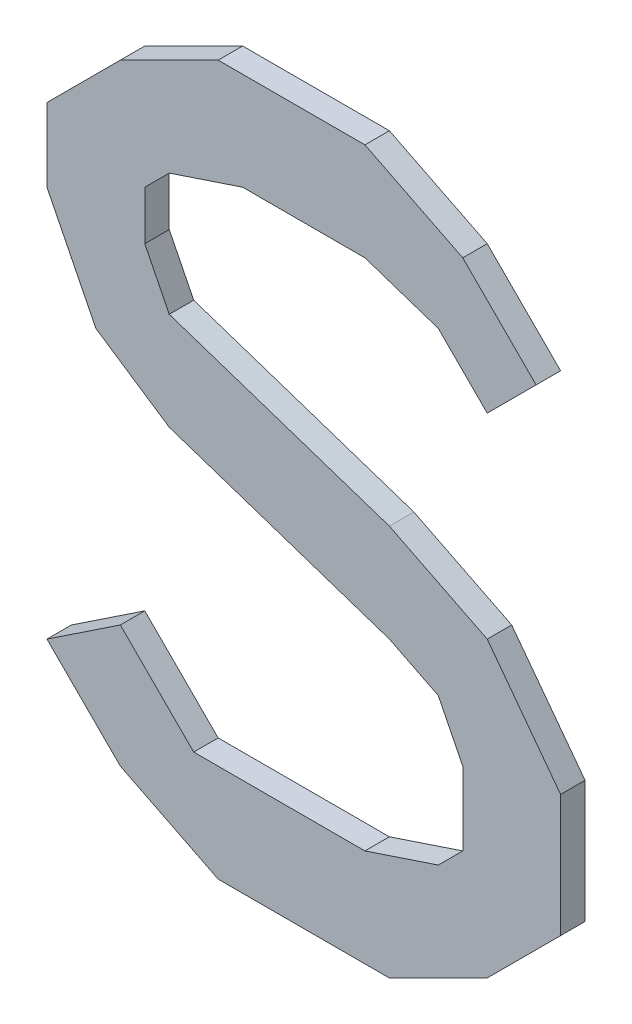
ISO-10303-21;
HEADER;
FILE_DESCRIPTION(('STEP AP214'),'2;1');
FILE_NAME('part.step','',(''),(''),'','','');
FILE_SCHEMA(('AUTOMOTIVE_DESIGN { 1 0 10303 214 1 1 1 1 }'));
ENDSEC;
DATA;
#1=APPLICATION_CONTEXT('core data for automotive mechanical design processes');
#2=APPLICATION_PROTOCOL_DEFINITION('international standard','automotive_design',2000,#1);
#3=PRODUCT_CONTEXT('',#1,'mechanical');
#4=PRODUCT('Part','Part','',(#3));
#5=PRODUCT_RELATED_PRODUCT_CATEGORY('part','',(#4));
#6=PRODUCT_DEFINITION_FORMATION('','',#4);
#7=PRODUCT_DEFINITION_CONTEXT('part definition',#1,'design');
#8=PRODUCT_DEFINITION('design','',#6,#7);
#9=PRODUCT_DEFINITION_SHAPE('','',#8);
#10=(LENGTH_UNIT() NAMED_UNIT(*) SI_UNIT(.MILLI.,.METRE.));
#11=(NAMED_UNIT(*) PLANE_ANGLE_UNIT() SI_UNIT($,.RADIAN.));
#12=(NAMED_UNIT(*) SI_UNIT($,.STERADIAN.) SOLID_ANGLE_UNIT());
#13=UNCERTAINTY_MEASURE_WITH_UNIT(LENGTH_MEASURE(1.E-05),#10,'distance_accuracy_value','');
#14=(GEOMETRIC_REPRESENTATION_CONTEXT(3) GLOBAL_UNCERTAINTY_ASSIGNED_CONTEXT((#13)) GLOBAL_UNIT_ASSIGNED_CONTEXT((#10,
#11,#12)) REPRESENTATION_CONTEXT('',''));
#15=CARTESIAN_POINT('',(0.,0.,0.));
#16=DIRECTION('',(0.,0.,1.));
#17=DIRECTION('',(1.,0.,0.));
#18=AXIS2_PLACEMENT_3D('',#15,#16,#17);
#19=CARTESIAN_POINT('',(0.07500112,0.07500112000001,0.));
#20=DIRECTION('',(0.,0.,-1.));
#21=DIRECTION('',(-1.,0.,0.));
#22=AXIS2_PLACEMENT_3D('',#19,#20,#21);
#23=PLANE('',#22);
#24=DIRECTION('',(0.707106781186548,-0.707106781186548,0.));
#25=VECTOR('',#24,1.);
#26=CARTESIAN_POINT('',(0.09500108,0.09500108,0.));
#27=LINE('',#26,#25);
#28=CARTESIAN_POINT('',(0.0650011400000088,0.125001019999999,0.));
#29=VERTEX_POINT('',#28);
#30=CARTESIAN_POINT('',(0.0950010800000023,0.0950010799999977,0.));
#31=VERTEX_POINT('',#30);
#32=EDGE_CURVE('E405',#29,#31,#27,.T.);
#33=ORIENTED_EDGE('',*,*,#32,.T.);
#34=DIRECTION('',(-0.707106781187048,-0.707106781186048,0.));
#35=VECTOR('',#34,1.);
#36=CARTESIAN_POINT('',(0.07500112,0.07500112000001,0.));
#37=LINE('',#36,#35);
#38=CARTESIAN_POINT('',(0.0750011199999975,0.0750011200000075,0.));
#39=VERTEX_POINT('',#38);
#40=EDGE_CURVE('E237',#31,#39,#37,.T.);
#41=ORIENTED_EDGE('',*,*,#40,.T.);
#42=DIRECTION('',(-0.707106781186548,0.707106781186548,0.));
#43=VECTOR('',#42,1.);
#44=CARTESIAN_POINT('',(0.05500116,0.09500108,0.));
#45=LINE('',#44,#43);
#46=CARTESIAN_POINT('',(0.0550011599999995,0.0950010799999984,0.));
#47=VERTEX_POINT('',#46);
#48=EDGE_CURVE('E19',#39,#47,#45,.T.);
#49=ORIENTED_EDGE('',*,*,#48,.T.);
#50=DIRECTION('',(-0.948683298050414,0.316227766017138,0.));
#51=VECTOR('',#50,1.);
#52=CARTESIAN_POINT('',(0.02500122000001,0.10500106,0.));
#53=LINE('',#52,#51);
#54=CARTESIAN_POINT('',(0.02500122000001,0.10500106,0.));
#55=VERTEX_POINT('',#54);
#56=EDGE_CURVE('E234',#47,#55,#53,.T.);
#57=ORIENTED_EDGE('',*,*,#56,.T.);
#58=DIRECTION('',(1.,0.,0.));
#59=VECTOR('',#58,1.);
#60=CARTESIAN_POINT('',(-0.02499868,0.10500106,0.));
#61=LINE('',#60,#59);
#62=CARTESIAN_POINT('',(-0.0249986800000005,0.105001060000002,0.));
#63=VERTEX_POINT('',#62);
#64=EDGE_CURVE('E255',#55,#63,#61,.F.);
#65=ORIENTED_EDGE('',*,*,#64,.T.);
#66=DIRECTION('',(-0.948683298050414,-0.316227766017138,0.));
#67=VECTOR('',#66,1.);
#68=CARTESIAN_POINT('',(-0.05499861999999,0.09500108,0.));
#69=LINE('',#68,#67);
#70=CARTESIAN_POINT('',(-0.0549986199999913,0.0950010800000013,0.));
#71=VERTEX_POINT('',#70);
#72=EDGE_CURVE('E260',#63,#71,#69,.T.);
#73=ORIENTED_EDGE('',*,*,#72,.T.);
#74=DIRECTION('',(-0.707106781186548,-0.707106781186548,0.));
#75=VECTOR('',#74,1.);
#76=CARTESIAN_POINT('',(-0.0649986,0.0850011,0.));
#77=LINE('',#76,#75);
#78=CARTESIAN_POINT('',(-0.0649986,0.0850011,0.));
#79=VERTEX_POINT('',#78);
#80=EDGE_CURVE('E265',#71,#79,#77,.T.);
#81=ORIENTED_EDGE('',*,*,#80,.T.);
#82=DIRECTION('',(0.,1.,0.));
#83=VECTOR('',#82,1.);
#84=CARTESIAN_POINT('',(-0.0649986,0.06500114000001,0.));
#85=LINE('',#84,#83);
#86=CARTESIAN_POINT('',(-0.064998599999999,0.0650011400000105,0.));
#87=VERTEX_POINT('',#86);
#88=EDGE_CURVE('E270',#79,#87,#85,.F.);
#89=ORIENTED_EDGE('',*,*,#88,.T.);
#90=DIRECTION('',(0.447213595499958,-0.894427190999916,0.));
#91=VECTOR('',#90,1.);
#92=CARTESIAN_POINT('',(-0.05499861999999,0.04500118,0.));
#93=LINE('',#92,#91);
#94=CARTESIAN_POINT('',(-0.0549986199999902,0.0450011799999993,0.));
#95=VERTEX_POINT('',#94);
#96=EDGE_CURVE('E275',#87,#95,#93,.T.);
#97=ORIENTED_EDGE('',*,*,#96,.T.);
#98=DIRECTION('',(0.948683298050514,-0.316227766016838,0.));
#99=VECTOR('',#98,1.);
#100=CARTESIAN_POINT('',(0.0350012,0.01500124,0.));
#101=LINE('',#100,#99);
#102=CARTESIAN_POINT('',(0.0350012000000016,0.015001240000002,0.));
#103=VERTEX_POINT('',#102);
#104=EDGE_CURVE('E280',#95,#103,#101,.T.);
#105=ORIENTED_EDGE('',*,*,#104,.T.);
#106=DIRECTION('',(0.894427190999916,-0.447213595499958,0.));
#107=VECTOR('',#106,1.);
#108=CARTESIAN_POINT('',(0.07500112,-0.004998719999989,0.));
#109=LINE('',#108,#107);
#110=CARTESIAN_POINT('',(0.0750011199999999,-0.00499871999998909,0.));
#111=VERTEX_POINT('',#110);
#112=EDGE_CURVE('E285',#103,#111,#109,.T.);
#113=ORIENTED_EDGE('',*,*,#112,.T.);
#114=DIRECTION('',(0.6,-0.8,0.));
#115=VECTOR('',#114,1.);
#116=CARTESIAN_POINT('',(0.10500106,-0.04499863999999,0.));
#117=LINE('',#116,#115);
#118=CARTESIAN_POINT('',(0.10500106,-0.04499863999999,0.));
#119=VERTEX_POINT('',#118);
#120=EDGE_CURVE('E290',#111,#119,#117,.T.);
#121=ORIENTED_EDGE('',*,*,#120,.T.);
#122=DIRECTION('',(0.,1.,0.));
#123=VECTOR('',#122,1.);
#124=CARTESIAN_POINT('',(0.10500106,-0.09499853999999,0.));
#125=LINE('',#124,#123);
#126=CARTESIAN_POINT('',(0.105001060000007,-0.0949985399999965,0.));
#127=VERTEX_POINT('',#126);
#128=EDGE_CURVE('E295',#119,#127,#125,.F.);
#129=ORIENTED_EDGE('',*,*,#128,.T.);
#130=DIRECTION('',(-0.707106781187048,-0.707106781186048,0.));
#131=VECTOR('',#130,1.);
#132=CARTESIAN_POINT('',(0.07500112,-0.12499848,0.));
#133=LINE('',#132,#131);
#134=CARTESIAN_POINT('',(0.07500112,-0.12499848,0.));
#135=VERTEX_POINT('',#134);
#136=EDGE_CURVE('E300',#127,#135,#133,.T.);
#137=ORIENTED_EDGE('',*,*,#136,.T.);
#138=DIRECTION('',(-0.894427190999916,-0.447213595499958,0.));
#139=VECTOR('',#138,1.);
#140=CARTESIAN_POINT('',(0.0350012,-0.14499844,0.));
#141=LINE('',#140,#139);
#142=CARTESIAN_POINT('',(0.0350012,-0.14499844,0.));
#143=VERTEX_POINT('',#142);
#144=EDGE_CURVE('E305',#135,#143,#141,.T.);
#145=ORIENTED_EDGE('',*,*,#144,.T.);
#146=DIRECTION('',(1.,0.,0.));
#147=VECTOR('',#146,1.);
#148=CARTESIAN_POINT('',(-0.03499866,-0.14499844,0.));
#149=LINE('',#148,#147);
#150=CARTESIAN_POINT('',(-0.03499866,-0.14499844,0.));
#151=VERTEX_POINT('',#150);
#152=EDGE_CURVE('E310',#143,#151,#149,.F.);
#153=ORIENTED_EDGE('',*,*,#152,.T.);
#154=DIRECTION('',(-0.894427190999916,0.447213595499958,0.));
#155=VECTOR('',#154,1.);
#156=CARTESIAN_POINT('',(-0.07499858,-0.12499848,0.));
#157=LINE('',#156,#155);
#158=CARTESIAN_POINT('',(-0.0749985799999988,-0.124998479999999,0.));
#159=VERTEX_POINT('',#158);
#160=EDGE_CURVE('E315',#151,#159,#157,.T.);
#161=ORIENTED_EDGE('',*,*,#160,.T.);
#162=DIRECTION('',(-0.707106781186548,0.707106781186548,0.));
#163=VECTOR('',#162,1.);
#164=CARTESIAN_POINT('',(-0.10499852,-0.09499853999999,0.));
#165=LINE('',#164,#163);
#166=CARTESIAN_POINT('',(-0.10499852,-0.0949985399999897,0.));
#167=VERTEX_POINT('',#166);
#168=EDGE_CURVE('E320',#159,#167,#165,.T.);
#169=ORIENTED_EDGE('',*,*,#168,.T.);
#170=DIRECTION('',(0.832050294337997,0.554700196224998,0.));
#171=VECTOR('',#170,1.);
#172=CARTESIAN_POINT('',(-0.07499858,-0.07499858,0.));
#173=LINE('',#172,#171);
#174=CARTESIAN_POINT('',(-0.07499858,-0.07499858,0.));
#175=VERTEX_POINT('',#174);
#176=EDGE_CURVE('E325',#167,#175,#173,.T.);
#177=ORIENTED_EDGE('',*,*,#176,.T.);
#178=DIRECTION('',(0.707106781186548,-0.707106781186548,0.));
#179=VECTOR('',#178,1.);
#180=CARTESIAN_POINT('',(-0.04499864,-0.10499852,0.));
#181=LINE('',#180,#179);
#182=CARTESIAN_POINT('',(-0.04499864,-0.10499852,0.));
#183=VERTEX_POINT('',#182);
#184=EDGE_CURVE('E330',#175,#183,#181,.T.);
#185=ORIENTED_EDGE('',*,*,#184,.T.);
#186=DIRECTION('',(1.,0.,0.));
#187=VECTOR('',#186,1.);
#188=CARTESIAN_POINT('',(0.02500122000001,-0.10499852,0.));
#189=LINE('',#188,#187);
#190=CARTESIAN_POINT('',(0.0250012200000098,-0.104998519999999,0.));
#191=VERTEX_POINT('',#190);
#192=EDGE_CURVE('E335',#183,#191,#189,.T.);
#193=ORIENTED_EDGE('',*,*,#192,.T.);
#194=DIRECTION('',(0.948683298050414,0.316227766017138,0.));
#195=VECTOR('',#194,1.);
#196=CARTESIAN_POINT('',(0.05500116,-0.09499853999999,0.));
#197=LINE('',#196,#195);
#198=CARTESIAN_POINT('',(0.0550011600000013,-0.0949985399999913,0.));
#199=VERTEX_POINT('',#198);
#200=EDGE_CURVE('E340',#191,#199,#197,.T.);
#201=ORIENTED_EDGE('',*,*,#200,.T.);
#202=DIRECTION('',(0.707106781186548,0.707106781186548,0.));
#203=VECTOR('',#202,1.);
#204=CARTESIAN_POINT('',(0.06500114000001,-0.08499855999999,0.));
#205=LINE('',#204,#203);
#206=CARTESIAN_POINT('',(0.06500114000001,-0.08499855999999,0.));
#207=VERTEX_POINT('',#206);
#208=EDGE_CURVE('E345',#199,#207,#205,.T.);
#209=ORIENTED_EDGE('',*,*,#208,.T.);
#210=DIRECTION('',(0.,1.,0.));
#211=VECTOR('',#210,1.);
#212=CARTESIAN_POINT('',(0.06500114000001,-0.05499861999999,0.));
#213=LINE('',#212,#211);
#214=CARTESIAN_POINT('',(0.065001140000007,-0.0549986199999915,0.));
#215=VERTEX_POINT('',#214);
#216=EDGE_CURVE('E350',#207,#215,#213,.T.);
#217=ORIENTED_EDGE('',*,*,#216,.T.);
#218=DIRECTION('',(-0.447213595499958,0.894427190999916,0.));
#219=VECTOR('',#218,1.);
#220=CARTESIAN_POINT('',(0.05500116,-0.03499866,0.));
#221=LINE('',#220,#219);
#222=CARTESIAN_POINT('',(0.05500116,-0.03499866,0.));
#223=VERTEX_POINT('',#222);
#224=EDGE_CURVE('E355',#215,#223,#221,.T.);
#225=ORIENTED_EDGE('',*,*,#224,.T.);
#226=DIRECTION('',(-0.894427190999916,0.447213595499958,0.));
#227=VECTOR('',#226,1.);
#228=CARTESIAN_POINT('',(0.0350012,-0.02499868,0.));
#229=LINE('',#228,#227);
#230=CARTESIAN_POINT('',(0.0350012000000003,-0.0249986799999993,0.));
#231=VERTEX_POINT('',#230);
#232=EDGE_CURVE('E360',#223,#231,#229,.T.);
#233=ORIENTED_EDGE('',*,*,#232,.T.);
#234=DIRECTION('',(-0.948683298050514,0.316227766016838,0.));
#235=VECTOR('',#234,1.);
#236=CARTESIAN_POINT('',(-0.05499861999999,0.00500126,0.));
#237=LINE('',#236,#235);
#238=CARTESIAN_POINT('',(-0.0549986199999882,0.00500126000000266,0.));
#239=VERTEX_POINT('',#238);
#240=EDGE_CURVE('E365',#231,#239,#237,.T.);
#241=ORIENTED_EDGE('',*,*,#240,.T.);
#242=DIRECTION('',(-0.832050294337997,0.554700196224998,0.));
#243=VECTOR('',#242,1.);
#244=CARTESIAN_POINT('',(-0.08499856,0.02500122000001,0.));
#245=LINE('',#244,#243);
#246=CARTESIAN_POINT('',(-0.08499856,0.02500122000001,0.));
#247=VERTEX_POINT('',#246);
#248=EDGE_CURVE('E370',#239,#247,#245,.T.);
#249=ORIENTED_EDGE('',*,*,#248,.T.);
#250=DIRECTION('',(-0.447213595499958,0.894427190999916,0.));
#251=VECTOR('',#250,1.);
#252=CARTESIAN_POINT('',(-0.10499852,0.06500114000001,0.));
#253=LINE('',#252,#251);
#254=CARTESIAN_POINT('',(-0.10499852,0.06500114000001,0.));
#255=VERTEX_POINT('',#254);
#256=EDGE_CURVE('E375',#247,#255,#253,.T.);
#257=ORIENTED_EDGE('',*,*,#256,.T.);
#258=DIRECTION('',(0.,1.,0.));
#259=VECTOR('',#258,1.);
#260=CARTESIAN_POINT('',(-0.10499852,0.09500108,0.));
#261=LINE('',#260,#259);
#262=CARTESIAN_POINT('',(-0.10499852,0.09500108,0.));
#263=VERTEX_POINT('',#262);
#264=EDGE_CURVE('E380',#255,#263,#261,.T.);
#265=ORIENTED_EDGE('',*,*,#264,.T.);
#266=DIRECTION('',(0.707106781186548,0.707106781186548,0.));
#267=VECTOR('',#266,1.);
#268=CARTESIAN_POINT('',(-0.07499858,0.12500102,0.));
#269=LINE('',#268,#267);
#270=CARTESIAN_POINT('',(-0.07499858,0.12500102,0.));
#271=VERTEX_POINT('',#270);
#272=EDGE_CURVE('E385',#263,#271,#269,.T.);
#273=ORIENTED_EDGE('',*,*,#272,.T.);
#274=DIRECTION('',(0.894427190999916,0.447213595499958,0.));
#275=VECTOR('',#274,1.);
#276=CARTESIAN_POINT('',(-0.03499866,0.14500098,0.));
#277=LINE('',#276,#275);
#278=CARTESIAN_POINT('',(-0.03499866,0.14500098,0.));
#279=VERTEX_POINT('',#278);
#280=EDGE_CURVE('E390',#271,#279,#277,.T.);
#281=ORIENTED_EDGE('',*,*,#280,.T.);
#282=DIRECTION('',(1.,0.,0.));
#283=VECTOR('',#282,1.);
#284=CARTESIAN_POINT('',(0.02500122000001,0.14500098,0.));
#285=LINE('',#284,#283);
#286=CARTESIAN_POINT('',(0.02500122000001,0.14500098,0.));
#287=VERTEX_POINT('',#286);
#288=EDGE_CURVE('E395',#279,#287,#285,.T.);
#289=ORIENTED_EDGE('',*,*,#288,.T.);
#290=DIRECTION('',(0.894427190999916,-0.447213595499958,0.));
#291=VECTOR('',#290,1.);
#292=CARTESIAN_POINT('',(0.06500114000001,0.12500102,0.));
#293=LINE('',#292,#291);
#294=EDGE_CURVE('E400',#287,#29,#293,.T.);
#295=ORIENTED_EDGE('',*,*,#294,.T.);
#296=EDGE_LOOP('',(#33,#41,#49,#57,#65,#73,#81,#89,#97,#105,#113,#121,#129,#137,#145,#153,#161,
#169,#177,#185,#193,#201,#209,#217,#225,#233,#241,#249,#257,#265,#273,#281,#289,#295));
#297=FACE_BOUND('',#296,.T.);
#298=ADVANCED_FACE('F16',(#297),#23,.T.);
#299=CARTESIAN_POINT('',(0.05500116,0.09500108,0.));
#300=DIRECTION('',(0.707106781186548,0.707106781186548,0.));
#301=DIRECTION('',(-0.707106781186548,0.707106781186548,0.));
#302=AXIS2_PLACEMENT_3D('',#299,#300,#301);
#303=PLANE('',#302);
#304=DIRECTION('',(0.,0.,1.));
#305=VECTOR('',#304,1.);
#306=CARTESIAN_POINT('',(0.07500112,0.07500112000001,0.));
#307=LINE('',#306,#305);
#308=CARTESIAN_POINT('',(0.0750011199999975,0.0750011200000075,0.01));
#309=VERTEX_POINT('',#308);
#310=EDGE_CURVE('E407',#39,#309,#307,.T.);
#311=ORIENTED_EDGE('',*,*,#310,.T.);
#312=DIRECTION('',(-0.707106781186724,0.707106781186371,0.));
#313=VECTOR('',#312,1.);
#314=CARTESIAN_POINT('',(0.07500112,0.07500112000001,0.01));
#315=LINE('',#314,#313);
#316=CARTESIAN_POINT('',(0.0550011599999995,0.0950010799999984,0.01));
#317=VERTEX_POINT('',#316);
#318=EDGE_CURVE('E252',#309,#317,#315,.T.);
#319=ORIENTED_EDGE('',*,*,#318,.T.);
#320=DIRECTION('',(0.,0.,1.));
#321=VECTOR('',#320,1.);
#322=CARTESIAN_POINT('',(0.0550011599999978,0.0950010799999935,0.));
#323=LINE('',#322,#321);
#324=EDGE_CURVE('E242',#317,#47,#323,.F.);
#325=ORIENTED_EDGE('',*,*,#324,.T.);
#326=ORIENTED_EDGE('',*,*,#48,.F.);
#327=EDGE_LOOP('',(#311,#319,#325,#326));
#328=FACE_BOUND('',#327,.T.);
#329=ADVANCED_FACE('F251',(#328),#303,.F.);
#330=CARTESIAN_POINT('',(0.02500122000001,0.10500106,0.));
#331=DIRECTION('',(0.316227766017138,0.948683298050414,0.));
#332=DIRECTION('',(-0.948683298050414,0.316227766017138,0.));
#333=AXIS2_PLACEMENT_3D('',#330,#331,#332);
#334=PLANE('',#333);
#335=ORIENTED_EDGE('',*,*,#324,.F.);
#336=DIRECTION('',(-0.948683298050482,0.316227766016933,0.));
#337=VECTOR('',#336,1.);
#338=CARTESIAN_POINT('',(0.05500116,0.09500108,0.01));
#339=LINE('',#338,#337);
#340=CARTESIAN_POINT('',(0.02500122000001,0.10500106,0.01));
#341=VERTEX_POINT('',#340);
#342=EDGE_CURVE('E412',#317,#341,#339,.T.);
#343=ORIENTED_EDGE('',*,*,#342,.T.);
#344=DIRECTION('',(0.,0.,1.));
#345=VECTOR('',#344,1.);
#346=CARTESIAN_POINT('',(0.02500122000001,0.10500106,0.));
#347=LINE('',#346,#345);
#348=EDGE_CURVE('E248',#341,#55,#347,.F.);
#349=ORIENTED_EDGE('',*,*,#348,.T.);
#350=ORIENTED_EDGE('',*,*,#56,.F.);
#351=EDGE_LOOP('',(#335,#343,#349,#350));
#352=FACE_BOUND('',#351,.T.);
#353=ADVANCED_FACE('F245',(#352),#334,.F.);
#354=CARTESIAN_POINT('',(-0.02499868,0.10500106,0.));
#355=DIRECTION('',(0.,1.,0.));
#356=DIRECTION('',(0.,0.,1.));
#357=AXIS2_PLACEMENT_3D('',#354,#355,#356);
#358=PLANE('',#357);
#359=ORIENTED_EDGE('',*,*,#348,.F.);
#360=DIRECTION('',(-1.,0.,0.));
#361=VECTOR('',#360,1.);
#362=CARTESIAN_POINT('',(0.07500112,0.10500106,0.01));
#363=LINE('',#362,#361);
#364=CARTESIAN_POINT('',(-0.0249986800000005,0.105001060000002,0.01));
#365=VERTEX_POINT('',#364);
#366=EDGE_CURVE('E414',#341,#365,#363,.T.);
#367=ORIENTED_EDGE('',*,*,#366,.T.);
#368=DIRECTION('',(0.,0.,1.));
#369=VECTOR('',#368,1.);
#370=CARTESIAN_POINT('',(-0.0249986800000022,0.105001060000006,0.));
#371=LINE('',#370,#369);
#372=EDGE_CURVE('E257',#365,#63,#371,.F.);
#373=ORIENTED_EDGE('',*,*,#372,.T.);
#374=ORIENTED_EDGE('',*,*,#64,.F.);
#375=EDGE_LOOP('',(#359,#367,#373,#374));
#376=FACE_BOUND('',#375,.T.);
#377=ADVANCED_FACE('F629',(#376),#358,.F.);
#378=CARTESIAN_POINT('',(-0.05499861999999,0.09500108,0.));
#379=DIRECTION('',(-0.316227766017138,0.948683298050414,0.));
#380=DIRECTION('',(-0.948683298050414,-0.316227766017138,0.));
#381=AXIS2_PLACEMENT_3D('',#378,#379,#380);
#382=PLANE('',#381);
#383=ORIENTED_EDGE('',*,*,#372,.F.);
#384=DIRECTION('',(-0.948683298050482,-0.316227766016933,0.));
#385=VECTOR('',#384,1.);
#386=CARTESIAN_POINT('',(-0.02499868,0.10500106,0.01));
#387=LINE('',#386,#385);
#388=CARTESIAN_POINT('',(-0.0549986199999913,0.0950010800000013,0.01));
#389=VERTEX_POINT('',#388);
#390=EDGE_CURVE('E417',#365,#389,#387,.T.);
#391=ORIENTED_EDGE('',*,*,#390,.T.);
#392=DIRECTION('',(0.,0.,1.));
#393=VECTOR('',#392,1.);
#394=CARTESIAN_POINT('',(-0.054998619999995,0.095001080000005,0.));
#395=LINE('',#394,#393);
#396=EDGE_CURVE('E262',#389,#71,#395,.F.);
#397=ORIENTED_EDGE('',*,*,#396,.T.);
#398=ORIENTED_EDGE('',*,*,#72,.F.);
#399=EDGE_LOOP('',(#383,#391,#397,#398));
#400=FACE_BOUND('',#399,.T.);
#401=ADVANCED_FACE('F626',(#400),#382,.F.);
#402=CARTESIAN_POINT('',(-0.0649986,0.0850011,0.));
#403=DIRECTION('',(-0.707106781186548,0.707106781186548,0.));
#404=DIRECTION('',(-0.707106781186548,-0.707106781186548,0.));
#405=AXIS2_PLACEMENT_3D('',#402,#403,#404);
#406=PLANE('',#405);
#407=ORIENTED_EDGE('',*,*,#396,.F.);
#408=DIRECTION('',(-0.707106781186902,-0.707106781186193,0.));
#409=VECTOR('',#408,1.);
#410=CARTESIAN_POINT('',(-0.05499861999999,0.09500108,0.01));
#411=LINE('',#410,#409);
#412=CARTESIAN_POINT('',(-0.0649986,0.0850011,0.01));
#413=VERTEX_POINT('',#412);
#414=EDGE_CURVE('E420',#389,#413,#411,.T.);
#415=ORIENTED_EDGE('',*,*,#414,.T.);
#416=DIRECTION('',(0.,0.,1.));
#417=VECTOR('',#416,1.);
#418=CARTESIAN_POINT('',(-0.0649986,0.0850011,0.));
#419=LINE('',#418,#417);
#420=EDGE_CURVE('E267',#413,#79,#419,.F.);
#421=ORIENTED_EDGE('',*,*,#420,.T.);
#422=ORIENTED_EDGE('',*,*,#80,.F.);
#423=EDGE_LOOP('',(#407,#415,#421,#422));
#424=FACE_BOUND('',#423,.T.);
#425=ADVANCED_FACE('F622',(#424),#406,.F.);
#426=CARTESIAN_POINT('',(-0.0649986,0.06500114000001,0.));
#427=DIRECTION('',(-1.,0.,0.));
#428=DIRECTION('',(0.,0.,1.));
#429=AXIS2_PLACEMENT_3D('',#426,#427,#428);
#430=PLANE('',#429);
#431=ORIENTED_EDGE('',*,*,#420,.F.);
#432=DIRECTION('',(0.,1.,0.));
#433=VECTOR('',#432,1.);
#434=CARTESIAN_POINT('',(-0.0649986,0.07500112000001,0.01));
#435=LINE('',#434,#433);
#436=CARTESIAN_POINT('',(-0.064998599999999,0.0650011400000105,0.01));
#437=VERTEX_POINT('',#436);
#438=EDGE_CURVE('E423',#413,#437,#435,.F.);
#439=ORIENTED_EDGE('',*,*,#438,.T.);
#440=DIRECTION('',(0.,0.,1.));
#441=VECTOR('',#440,1.);
#442=CARTESIAN_POINT('',(-0.064998599999996,0.065001140000012,0.));
#443=LINE('',#442,#441);
#444=EDGE_CURVE('E272',#437,#87,#443,.F.);
#445=ORIENTED_EDGE('',*,*,#444,.T.);
#446=ORIENTED_EDGE('',*,*,#88,.F.);
#447=EDGE_LOOP('',(#431,#439,#445,#446));
#448=FACE_BOUND('',#447,.T.);
#449=ADVANCED_FACE('F618',(#448),#430,.F.);
#450=CARTESIAN_POINT('',(-0.05499861999999,0.04500118,0.));
#451=DIRECTION('',(-0.894427190999916,-0.447213595499958,0.));
#452=DIRECTION('',(0.447213595499958,-0.894427190999916,0.));
#453=AXIS2_PLACEMENT_3D('',#450,#451,#452);
#454=PLANE('',#453);
#455=ORIENTED_EDGE('',*,*,#444,.F.);
#456=DIRECTION('',(0.447213595500138,-0.894427190999826,0.));
#457=VECTOR('',#456,1.);
#458=CARTESIAN_POINT('',(-0.0649986,0.06500114000001,0.01));
#459=LINE('',#458,#457);
#460=CARTESIAN_POINT('',(-0.0549986199999902,0.0450011799999993,0.01));
#461=VERTEX_POINT('',#460);
#462=EDGE_CURVE('E426',#437,#461,#459,.T.);
#463=ORIENTED_EDGE('',*,*,#462,.T.);
#464=DIRECTION('',(0.,0.,1.));
#465=VECTOR('',#464,1.);
#466=CARTESIAN_POINT('',(-0.054998619999991,0.045001179999997,0.));
#467=LINE('',#466,#465);
#468=EDGE_CURVE('E277',#461,#95,#467,.F.);
#469=ORIENTED_EDGE('',*,*,#468,.T.);
#470=ORIENTED_EDGE('',*,*,#96,.F.);
#471=EDGE_LOOP('',(#455,#463,#469,#470));
#472=FACE_BOUND('',#471,.T.);
#473=ADVANCED_FACE('F614',(#472),#454,.F.);
#474=CARTESIAN_POINT('',(0.0350012,0.01500124,0.));
#475=DIRECTION('',(-0.316227766016838,-0.948683298050514,0.));
#476=DIRECTION('',(0.948683298050514,-0.316227766016838,0.));
#477=AXIS2_PLACEMENT_3D('',#474,#475,#476);
#478=PLANE('',#477);
#479=ORIENTED_EDGE('',*,*,#468,.F.);
#480=DIRECTION('',(0.948683298050503,-0.31622776601687,0.));
#481=VECTOR('',#480,1.);
#482=CARTESIAN_POINT('',(-0.05499861999999,0.04500118,0.01));
#483=LINE('',#482,#481);
#484=CARTESIAN_POINT('',(0.0350012000000016,0.015001240000002,0.01));
#485=VERTEX_POINT('',#484);
#486=EDGE_CURVE('E429',#461,#485,#483,.T.);
#487=ORIENTED_EDGE('',*,*,#486,.T.);
#488=DIRECTION('',(0.,0.,1.));
#489=VECTOR('',#488,1.);
#490=CARTESIAN_POINT('',(0.0350012000000044,0.0150012400000088,0.));
#491=LINE('',#490,#489);
#492=EDGE_CURVE('E282',#485,#103,#491,.F.);
#493=ORIENTED_EDGE('',*,*,#492,.T.);
#494=ORIENTED_EDGE('',*,*,#104,.F.);
#495=EDGE_LOOP('',(#479,#487,#493,#494));
#496=FACE_BOUND('',#495,.T.);
#497=ADVANCED_FACE('F610',(#496),#478,.F.);
#498=CARTESIAN_POINT('',(0.07500112,-0.004998719999989,0.));
#499=DIRECTION('',(-0.447213595499958,-0.894427190999916,0.));
#500=DIRECTION('',(0.894427190999916,-0.447213595499958,0.));
#501=AXIS2_PLACEMENT_3D('',#498,#499,#500);
#502=PLANE('',#501);
#503=ORIENTED_EDGE('',*,*,#492,.F.);
#504=DIRECTION('',(0.894427191000014,-0.447213595499761,0.));
#505=VECTOR('',#504,1.);
#506=CARTESIAN_POINT('',(0.0350012,0.01500124,0.01));
#507=LINE('',#506,#505);
#508=CARTESIAN_POINT('',(0.0750011199999999,-0.00499871999998909,0.01));
#509=VERTEX_POINT('',#508);
#510=EDGE_CURVE('E432',#485,#509,#507,.T.);
#511=ORIENTED_EDGE('',*,*,#510,.T.);
#512=DIRECTION('',(0.,0.,1.));
#513=VECTOR('',#512,1.);
#514=CARTESIAN_POINT('',(0.0750011199999995,-0.00499871999998936,0.));
#515=LINE('',#514,#513);
#516=EDGE_CURVE('E287',#509,#111,#515,.F.);
#517=ORIENTED_EDGE('',*,*,#516,.T.);
#518=ORIENTED_EDGE('',*,*,#112,.F.);
#519=EDGE_LOOP('',(#503,#511,#517,#518));
#520=FACE_BOUND('',#519,.T.);
#521=ADVANCED_FACE('F606',(#520),#502,.F.);
#522=CARTESIAN_POINT('',(0.10500106,-0.04499863999999,0.));
#523=DIRECTION('',(-0.8,-0.6,0.));
#524=DIRECTION('',(0.6,-0.8,0.));
#525=AXIS2_PLACEMENT_3D('',#522,#523,#524);
#526=PLANE('',#525);
#527=ORIENTED_EDGE('',*,*,#516,.F.);
#528=DIRECTION('',(0.59999999999999,-0.800000000000007,0.));
#529=VECTOR('',#528,1.);
#530=CARTESIAN_POINT('',(0.07500112,-0.004998719999989,0.01));
#531=LINE('',#530,#529);
#532=CARTESIAN_POINT('',(0.10500106,-0.04499863999999,0.01));
#533=VERTEX_POINT('',#532);
#534=EDGE_CURVE('E435',#509,#533,#531,.T.);
#535=ORIENTED_EDGE('',*,*,#534,.T.);
#536=DIRECTION('',(0.,0.,1.));
#537=VECTOR('',#536,1.);
#538=CARTESIAN_POINT('',(0.10500106,-0.04499863999999,0.));
#539=LINE('',#538,#537);
#540=EDGE_CURVE('E292',#533,#119,#539,.F.);
#541=ORIENTED_EDGE('',*,*,#540,.T.);
#542=ORIENTED_EDGE('',*,*,#120,.F.);
#543=EDGE_LOOP('',(#527,#535,#541,#542));
#544=FACE_BOUND('',#543,.T.);
#545=ADVANCED_FACE('F602',(#544),#526,.F.);
#546=CARTESIAN_POINT('',(0.10500106,-0.09499853999999,0.));
#547=DIRECTION('',(-1.,0.,0.));
#548=DIRECTION('',(0.,0.,1.));
#549=AXIS2_PLACEMENT_3D('',#546,#547,#548);
#550=PLANE('',#549);
#551=ORIENTED_EDGE('',*,*,#540,.F.);
#552=DIRECTION('',(0.,1.,0.));
#553=VECTOR('',#552,1.);
#554=CARTESIAN_POINT('',(0.10500106,0.07500112000001,0.01));
#555=LINE('',#554,#553);
#556=CARTESIAN_POINT('',(0.105001060000007,-0.0949985399999965,0.01));
#557=VERTEX_POINT('',#556);
#558=EDGE_CURVE('E438',#533,#557,#555,.F.);
#559=ORIENTED_EDGE('',*,*,#558,.T.);
#560=DIRECTION('',(0.,0.,1.));
#561=VECTOR('',#560,1.);
#562=CARTESIAN_POINT('',(0.105001060000026,-0.0949985400000162,0.));
#563=LINE('',#562,#561);
#564=EDGE_CURVE('E297',#557,#127,#563,.F.);
#565=ORIENTED_EDGE('',*,*,#564,.T.);
#566=ORIENTED_EDGE('',*,*,#128,.F.);
#567=EDGE_LOOP('',(#551,#559,#565,#566));
#568=FACE_BOUND('',#567,.T.);
#569=ADVANCED_FACE('F598',(#568),#550,.F.);
#570=CARTESIAN_POINT('',(0.07500112,-0.12499848,0.));
#571=DIRECTION('',(-0.707106781186048,0.707106781187048,0.));
#572=DIRECTION('',(-0.707106781187048,-0.707106781186048,0.));
#573=AXIS2_PLACEMENT_3D('',#570,#571,#572);
#574=PLANE('',#573);
#575=ORIENTED_EDGE('',*,*,#564,.F.);
#576=DIRECTION('',(-0.70710678118643,-0.707106781186666,0.));
#577=VECTOR('',#576,1.);
#578=CARTESIAN_POINT('',(0.10500106,-0.09499853999999,0.01));
#579=LINE('',#578,#577);
#580=CARTESIAN_POINT('',(0.07500112,-0.12499848,0.01));
#581=VERTEX_POINT('',#580);
#582=EDGE_CURVE('E441',#557,#581,#579,.T.);
#583=ORIENTED_EDGE('',*,*,#582,.T.);
#584=DIRECTION('',(0.,0.,1.));
#585=VECTOR('',#584,1.);
#586=CARTESIAN_POINT('',(0.07500112,-0.12499848,0.));
#587=LINE('',#586,#585);
#588=EDGE_CURVE('E302',#581,#135,#587,.F.);
#589=ORIENTED_EDGE('',*,*,#588,.T.);
#590=ORIENTED_EDGE('',*,*,#136,.F.);
#591=EDGE_LOOP('',(#575,#583,#589,#590));
#592=FACE_BOUND('',#591,.T.);
#593=ADVANCED_FACE('F594',(#592),#574,.F.);
#594=CARTESIAN_POINT('',(0.0350012,-0.14499844,0.));
#595=DIRECTION('',(-0.447213595499958,0.894427190999916,0.));
#596=DIRECTION('',(-0.894427190999916,-0.447213595499958,0.));
#597=AXIS2_PLACEMENT_3D('',#594,#595,#596);
#598=PLANE('',#597);
#599=ORIENTED_EDGE('',*,*,#588,.F.);
#600=DIRECTION('',(-0.894427190999916,-0.447213595499958,0.));
#601=VECTOR('',#600,1.);
#602=CARTESIAN_POINT('',(0.07500112,-0.12499848,0.01));
#603=LINE('',#602,#601);
#604=CARTESIAN_POINT('',(0.0350012,-0.14499844,0.01));
#605=VERTEX_POINT('',#604);
#606=EDGE_CURVE('E444',#581,#605,#603,.T.);
#607=ORIENTED_EDGE('',*,*,#606,.T.);
#608=DIRECTION('',(0.,0.,1.));
#609=VECTOR('',#608,1.);
#610=CARTESIAN_POINT('',(0.0350012,-0.14499844,0.));
#611=LINE('',#610,#609);
#612=EDGE_CURVE('E307',#605,#143,#611,.F.);
#613=ORIENTED_EDGE('',*,*,#612,.T.);
#614=ORIENTED_EDGE('',*,*,#144,.F.);
#615=EDGE_LOOP('',(#599,#607,#613,#614));
#616=FACE_BOUND('',#615,.T.);
#617=ADVANCED_FACE('F590',(#616),#598,.F.);
#618=CARTESIAN_POINT('',(-0.03499866,-0.14499844,0.));
#619=DIRECTION('',(0.,1.,0.));
#620=DIRECTION('',(0.,0.,1.));
#621=AXIS2_PLACEMENT_3D('',#618,#619,#620);
#622=PLANE('',#621);
#623=ORIENTED_EDGE('',*,*,#612,.F.);
#624=DIRECTION('',(-1.,0.,0.));
#625=VECTOR('',#624,1.);
#626=CARTESIAN_POINT('',(0.07500112,-0.14499844,0.01));
#627=LINE('',#626,#625);
#628=CARTESIAN_POINT('',(-0.03499866,-0.14499844,0.01));
#629=VERTEX_POINT('',#628);
#630=EDGE_CURVE('E447',#605,#629,#627,.T.);
#631=ORIENTED_EDGE('',*,*,#630,.T.);
#632=DIRECTION('',(0.,0.,1.));
#633=VECTOR('',#632,1.);
#634=CARTESIAN_POINT('',(-0.03499866,-0.14499844,0.));
#635=LINE('',#634,#633);
#636=EDGE_CURVE('E312',#629,#151,#635,.F.);
#637=ORIENTED_EDGE('',*,*,#636,.T.);
#638=ORIENTED_EDGE('',*,*,#152,.F.);
#639=EDGE_LOOP('',(#623,#631,#637,#638));
#640=FACE_BOUND('',#639,.T.);
#641=ADVANCED_FACE('F586',(#640),#622,.F.);
#642=CARTESIAN_POINT('',(-0.07499858,-0.12499848,0.));
#643=DIRECTION('',(0.447213595499958,0.894427190999916,0.));
#644=DIRECTION('',(-0.894427190999916,0.447213595499958,0.));
#645=AXIS2_PLACEMENT_3D('',#642,#643,#644);
#646=PLANE('',#645);
#647=ORIENTED_EDGE('',*,*,#636,.F.);
#648=DIRECTION('',(-0.894427190999916,0.447213595499958,0.));
#649=VECTOR('',#648,1.);
#650=CARTESIAN_POINT('',(-0.03499866,-0.14499844,0.01));
#651=LINE('',#650,#649);
#652=CARTESIAN_POINT('',(-0.0749985799999988,-0.124998479999999,0.01));
#653=VERTEX_POINT('',#652);
#654=EDGE_CURVE('E450',#629,#653,#651,.T.);
#655=ORIENTED_EDGE('',*,*,#654,.T.);
#656=DIRECTION('',(0.,0.,1.));
#657=VECTOR('',#656,1.);
#658=CARTESIAN_POINT('',(-0.074998579999995,-0.124998479999995,0.));
#659=LINE('',#658,#657);
#660=EDGE_CURVE('E317',#653,#159,#659,.F.);
#661=ORIENTED_EDGE('',*,*,#660,.T.);
#662=ORIENTED_EDGE('',*,*,#160,.F.);
#663=EDGE_LOOP('',(#647,#655,#661,#662));
#664=FACE_BOUND('',#663,.T.);
#665=ADVANCED_FACE('F582',(#664),#646,.F.);
#666=CARTESIAN_POINT('',(-0.10499852,-0.09499853999999,0.));
#667=DIRECTION('',(0.707106781186548,0.707106781186548,0.));
#668=DIRECTION('',(-0.707106781186548,0.707106781186548,0.));
#669=AXIS2_PLACEMENT_3D('',#666,#667,#668);
#670=PLANE('',#669);
#671=ORIENTED_EDGE('',*,*,#660,.F.);
#672=DIRECTION('',(-0.70710678118643,0.707106781186666,0.));
#673=VECTOR('',#672,1.);
#674=CARTESIAN_POINT('',(-0.07499858,-0.12499848,0.01));
#675=LINE('',#674,#673);
#676=CARTESIAN_POINT('',(-0.10499852,-0.0949985399999897,0.01));
#677=VERTEX_POINT('',#676);
#678=EDGE_CURVE('E453',#653,#677,#675,.T.);
#679=ORIENTED_EDGE('',*,*,#678,.T.);
#680=DIRECTION('',(0.,0.,1.));
#681=VECTOR('',#680,1.);
#682=CARTESIAN_POINT('',(-0.104998520000001,-0.0949985399999886,0.));
#683=LINE('',#682,#681);
#684=EDGE_CURVE('E322',#677,#167,#683,.F.);
#685=ORIENTED_EDGE('',*,*,#684,.T.);
#686=ORIENTED_EDGE('',*,*,#168,.F.);
#687=EDGE_LOOP('',(#671,#679,#685,#686));
#688=FACE_BOUND('',#687,.T.);
#689=ADVANCED_FACE('F578',(#688),#670,.F.);
#690=CARTESIAN_POINT('',(-0.07499858,-0.07499858,0.));
#691=DIRECTION('',(0.554700196224998,-0.832050294337997,0.));
#692=DIRECTION('',(0.832050294337997,0.554700196224998,0.));
#693=AXIS2_PLACEMENT_3D('',#690,#691,#692);
#694=PLANE('',#693);
#695=ORIENTED_EDGE('',*,*,#684,.F.);
#696=DIRECTION('',(0.832050294337972,0.554700196225037,0.));
#697=VECTOR('',#696,1.);
#698=CARTESIAN_POINT('',(-0.10499852,-0.09499853999999,0.01));
#699=LINE('',#698,#697);
#700=CARTESIAN_POINT('',(-0.07499858,-0.07499858,0.01));
#701=VERTEX_POINT('',#700);
#702=EDGE_CURVE('E456',#677,#701,#699,.T.);
#703=ORIENTED_EDGE('',*,*,#702,.T.);
#704=DIRECTION('',(0.,0.,1.));
#705=VECTOR('',#704,1.);
#706=CARTESIAN_POINT('',(-0.07499858,-0.07499858,0.));
#707=LINE('',#706,#705);
#708=EDGE_CURVE('E327',#701,#175,#707,.F.);
#709=ORIENTED_EDGE('',*,*,#708,.T.);
#710=ORIENTED_EDGE('',*,*,#176,.F.);
#711=EDGE_LOOP('',(#695,#703,#709,#710));
#712=FACE_BOUND('',#711,.T.);
#713=ADVANCED_FACE('F574',(#712),#694,.F.);
#714=CARTESIAN_POINT('',(-0.04499864,-0.10499852,0.));
#715=DIRECTION('',(-0.707106781186548,-0.707106781186548,0.));
#716=DIRECTION('',(0.707106781186548,-0.707106781186548,0.));
#717=AXIS2_PLACEMENT_3D('',#714,#715,#716);
#718=PLANE('',#717);
#719=ORIENTED_EDGE('',*,*,#708,.F.);
#720=DIRECTION('',(0.707106781186548,-0.707106781186547,0.));
#721=VECTOR('',#720,1.);
#722=CARTESIAN_POINT('',(-0.07499858,-0.07499858,0.01));
#723=LINE('',#722,#721);
#724=CARTESIAN_POINT('',(-0.04499864,-0.10499852,0.01));
#725=VERTEX_POINT('',#724);
#726=EDGE_CURVE('E459',#701,#725,#723,.T.);
#727=ORIENTED_EDGE('',*,*,#726,.T.);
#728=DIRECTION('',(0.,0.,-1.));
#729=VECTOR('',#728,1.);
#730=CARTESIAN_POINT('',(-0.04499864,-0.10499852,0.));
#731=LINE('',#730,#729);
#732=EDGE_CURVE('E332',#725,#183,#731,.T.);
#733=ORIENTED_EDGE('',*,*,#732,.T.);
#734=ORIENTED_EDGE('',*,*,#184,.F.);
#735=EDGE_LOOP('',(#719,#727,#733,#734));
#736=FACE_BOUND('',#735,.T.);
#737=ADVANCED_FACE('F570',(#736),#718,.F.);
#738=CARTESIAN_POINT('',(0.02500122000001,-0.10499852,0.));
#739=DIRECTION('',(0.,-1.,0.));
#740=DIRECTION('',(0.,0.,-1.));
#741=AXIS2_PLACEMENT_3D('',#738,#739,#740);
#742=PLANE('',#741);
#743=ORIENTED_EDGE('',*,*,#732,.F.);
#744=DIRECTION('',(-1.,0.,0.));
#745=VECTOR('',#744,1.);
#746=CARTESIAN_POINT('',(0.07500112,-0.10499852,0.01));
#747=LINE('',#746,#745);
#748=CARTESIAN_POINT('',(0.0250012200000098,-0.104998519999999,0.01));
#749=VERTEX_POINT('',#748);
#750=EDGE_CURVE('E462',#725,#749,#747,.F.);
#751=ORIENTED_EDGE('',*,*,#750,.T.);
#752=DIRECTION('',(0.,0.,1.));
#753=VECTOR('',#752,1.);
#754=CARTESIAN_POINT('',(0.0250012200000092,-0.104998519999997,0.));
#755=LINE('',#754,#753);
#756=EDGE_CURVE('E337',#749,#191,#755,.F.);
#757=ORIENTED_EDGE('',*,*,#756,.T.);
#758=ORIENTED_EDGE('',*,*,#192,.F.);
#759=EDGE_LOOP('',(#743,#751,#757,#758));
#760=FACE_BOUND('',#759,.T.);
#761=ADVANCED_FACE('F566',(#760),#742,.F.);
#762=CARTESIAN_POINT('',(0.05500116,-0.09499853999999,0.));
#763=DIRECTION('',(0.316227766017138,-0.948683298050414,0.));
#764=DIRECTION('',(0.948683298050414,0.316227766017138,0.));
#765=AXIS2_PLACEMENT_3D('',#762,#763,#764);
#766=PLANE('',#765);
#767=ORIENTED_EDGE('',*,*,#756,.F.);
#768=DIRECTION('',(0.948683298050387,0.316227766017217,0.));
#769=VECTOR('',#768,1.);
#770=CARTESIAN_POINT('',(0.02500122000001,-0.10499852,0.01));
#771=LINE('',#770,#769);
#772=CARTESIAN_POINT('',(0.0550011600000013,-0.0949985399999913,0.01));
#773=VERTEX_POINT('',#772);
#774=EDGE_CURVE('E465',#749,#773,#771,.T.);
#775=ORIENTED_EDGE('',*,*,#774,.T.);
#776=DIRECTION('',(0.,0.,1.));
#777=VECTOR('',#776,1.);
#778=CARTESIAN_POINT('',(0.055001160000005,-0.094998539999995,0.));
#779=LINE('',#778,#777);
#780=EDGE_CURVE('E342',#773,#199,#779,.F.);
#781=ORIENTED_EDGE('',*,*,#780,.T.);
#782=ORIENTED_EDGE('',*,*,#200,.F.);
#783=EDGE_LOOP('',(#767,#775,#781,#782));
#784=FACE_BOUND('',#783,.T.);
#785=ADVANCED_FACE('F562',(#784),#766,.F.);
#786=CARTESIAN_POINT('',(0.06500114000001,-0.08499855999999,0.));
#787=DIRECTION('',(0.707106781186548,-0.707106781186548,0.));
#788=DIRECTION('',(0.707106781186548,0.707106781186548,0.));
#789=AXIS2_PLACEMENT_3D('',#786,#787,#788);
#790=PLANE('',#789);
#791=ORIENTED_EDGE('',*,*,#780,.F.);
#792=DIRECTION('',(0.707106781186901,0.707106781186194,0.));
#793=VECTOR('',#792,1.);
#794=CARTESIAN_POINT('',(0.05500116,-0.09499853999999,0.01));
#795=LINE('',#794,#793);
#796=CARTESIAN_POINT('',(0.06500114000001,-0.08499855999999,0.01));
#797=VERTEX_POINT('',#796);
#798=EDGE_CURVE('E468',#773,#797,#795,.T.);
#799=ORIENTED_EDGE('',*,*,#798,.T.);
#800=DIRECTION('',(0.,0.,-1.));
#801=VECTOR('',#800,1.);
#802=CARTESIAN_POINT('',(0.06500114000001,-0.08499855999999,0.));
#803=LINE('',#802,#801);
#804=EDGE_CURVE('E347',#797,#207,#803,.T.);
#805=ORIENTED_EDGE('',*,*,#804,.T.);
#806=ORIENTED_EDGE('',*,*,#208,.F.);
#807=EDGE_LOOP('',(#791,#799,#805,#806));
#808=FACE_BOUND('',#807,.T.);
#809=ADVANCED_FACE('F558',(#808),#790,.F.);
#810=CARTESIAN_POINT('',(0.06500114000001,-0.05499861999999,0.));
#811=DIRECTION('',(1.,0.,0.));
#812=DIRECTION('',(0.,0.,-1.));
#813=AXIS2_PLACEMENT_3D('',#810,#811,#812);
#814=PLANE('',#813);
#815=ORIENTED_EDGE('',*,*,#804,.F.);
#816=DIRECTION('',(0.,1.,0.));
#817=VECTOR('',#816,1.);
#818=CARTESIAN_POINT('',(0.06500114000001,0.07500112000001,0.01));
#819=LINE('',#818,#817);
#820=CARTESIAN_POINT('',(0.065001140000007,-0.0549986199999915,0.01));
#821=VERTEX_POINT('',#820);
#822=EDGE_CURVE('E471',#797,#821,#819,.T.);
#823=ORIENTED_EDGE('',*,*,#822,.T.);
#824=DIRECTION('',(0.,0.,1.));
#825=VECTOR('',#824,1.);
#826=CARTESIAN_POINT('',(0.065001139999998,-0.054998619999996,0.));
#827=LINE('',#826,#825);
#828=EDGE_CURVE('E352',#821,#215,#827,.F.);
#829=ORIENTED_EDGE('',*,*,#828,.T.);
#830=ORIENTED_EDGE('',*,*,#216,.F.);
#831=EDGE_LOOP('',(#815,#823,#829,#830));
#832=FACE_BOUND('',#831,.T.);
#833=ADVANCED_FACE('F554',(#832),#814,.F.);
#834=CARTESIAN_POINT('',(0.05500116,-0.03499866,0.));
#835=DIRECTION('',(0.894427190999916,0.447213595499958,0.));
#836=DIRECTION('',(-0.447213595499958,0.894427190999916,0.));
#837=AXIS2_PLACEMENT_3D('',#834,#835,#836);
#838=PLANE('',#837);
#839=ORIENTED_EDGE('',*,*,#828,.F.);
#840=DIRECTION('',(-0.447213595500495,0.894427190999647,0.));
#841=VECTOR('',#840,1.);
#842=CARTESIAN_POINT('',(0.06500114000001,-0.05499861999999,0.01));
#843=LINE('',#842,#841);
#844=CARTESIAN_POINT('',(0.05500116,-0.03499866,0.01));
#845=VERTEX_POINT('',#844);
#846=EDGE_CURVE('E474',#821,#845,#843,.T.);
#847=ORIENTED_EDGE('',*,*,#846,.T.);
#848=DIRECTION('',(0.,0.,1.));
#849=VECTOR('',#848,1.);
#850=CARTESIAN_POINT('',(0.05500116,-0.03499866,0.));
#851=LINE('',#850,#849);
#852=EDGE_CURVE('E357',#845,#223,#851,.F.);
#853=ORIENTED_EDGE('',*,*,#852,.T.);
#854=ORIENTED_EDGE('',*,*,#224,.F.);
#855=EDGE_LOOP('',(#839,#847,#853,#854));
#856=FACE_BOUND('',#855,.T.);
#857=ADVANCED_FACE('F550',(#856),#838,.F.);
#858=CARTESIAN_POINT('',(0.0350012,-0.02499868,0.));
#859=DIRECTION('',(0.447213595499958,0.894427190999916,0.));
#860=DIRECTION('',(-0.894427190999916,0.447213595499958,0.));
#861=AXIS2_PLACEMENT_3D('',#858,#859,#860);
#862=PLANE('',#861);
#863=ORIENTED_EDGE('',*,*,#852,.F.);
#864=DIRECTION('',(-0.894427190999916,0.447213595499958,0.));
#865=VECTOR('',#864,1.);
#866=CARTESIAN_POINT('',(0.05500116,-0.03499866,0.01));
#867=LINE('',#866,#865);
#868=CARTESIAN_POINT('',(0.0350012000000003,-0.0249986799999993,0.01));
#869=VERTEX_POINT('',#868);
#870=EDGE_CURVE('E477',#845,#869,#867,.T.);
#871=ORIENTED_EDGE('',*,*,#870,.T.);
#872=DIRECTION('',(0.,0.,1.));
#873=VECTOR('',#872,1.);
#874=CARTESIAN_POINT('',(0.035001200000001,-0.024998679999997,0.));
#875=LINE('',#874,#873);
#876=EDGE_CURVE('E362',#869,#231,#875,.F.);
#877=ORIENTED_EDGE('',*,*,#876,.T.);
#878=ORIENTED_EDGE('',*,*,#232,.F.);
#879=EDGE_LOOP('',(#863,#871,#877,#878));
#880=FACE_BOUND('',#879,.T.);
#881=ADVANCED_FACE('F546',(#880),#862,.F.);
#882=CARTESIAN_POINT('',(-0.05499861999999,0.00500126,0.));
#883=DIRECTION('',(0.316227766016838,0.948683298050514,0.));
#884=DIRECTION('',(-0.948683298050514,0.316227766016838,0.));
#885=AXIS2_PLACEMENT_3D('',#882,#883,#884);
#886=PLANE('',#885);
#887=ORIENTED_EDGE('',*,*,#876,.F.);
#888=DIRECTION('',(-0.948683298050503,0.31622776601687,0.));
#889=VECTOR('',#888,1.);
#890=CARTESIAN_POINT('',(0.0350012,-0.02499868,0.01));
#891=LINE('',#890,#889);
#892=CARTESIAN_POINT('',(-0.0549986199999882,0.00500126000000266,0.01));
#893=VERTEX_POINT('',#892);
#894=EDGE_CURVE('E480',#869,#893,#891,.T.);
#895=ORIENTED_EDGE('',*,*,#894,.T.);
#896=DIRECTION('',(0.,0.,1.));
#897=VECTOR('',#896,1.);
#898=CARTESIAN_POINT('',(-0.0549986199999829,0.00500126000001063,0.));
#899=LINE('',#898,#897);
#900=EDGE_CURVE('E367',#893,#239,#899,.F.);
#901=ORIENTED_EDGE('',*,*,#900,.T.);
#902=ORIENTED_EDGE('',*,*,#240,.F.);
#903=EDGE_LOOP('',(#887,#895,#901,#902));
#904=FACE_BOUND('',#903,.T.);
#905=ADVANCED_FACE('F542',(#904),#886,.F.);
#906=CARTESIAN_POINT('',(-0.08499856,0.02500122000001,0.));
#907=DIRECTION('',(0.554700196224998,0.832050294337997,0.));
#908=DIRECTION('',(-0.832050294337997,0.554700196224998,0.));
#909=AXIS2_PLACEMENT_3D('',#906,#907,#908);
#910=PLANE('',#909);
#911=ORIENTED_EDGE('',*,*,#900,.F.);
#912=DIRECTION('',(-0.832050294337801,0.554700196225293,0.));
#913=VECTOR('',#912,1.);
#914=CARTESIAN_POINT('',(-0.05499861999999,0.00500126000000001,0.01));
#915=LINE('',#914,#913);
#916=CARTESIAN_POINT('',(-0.08499856,0.02500122000001,0.01));
#917=VERTEX_POINT('',#916);
#918=EDGE_CURVE('E483',#893,#917,#915,.T.);
#919=ORIENTED_EDGE('',*,*,#918,.T.);
#920=DIRECTION('',(0.,0.,1.));
#921=VECTOR('',#920,1.);
#922=CARTESIAN_POINT('',(-0.08499856,0.02500122000001,0.));
#923=LINE('',#922,#921);
#924=EDGE_CURVE('E372',#917,#247,#923,.F.);
#925=ORIENTED_EDGE('',*,*,#924,.T.);
#926=ORIENTED_EDGE('',*,*,#248,.F.);
#927=EDGE_LOOP('',(#911,#919,#925,#926));
#928=FACE_BOUND('',#927,.T.);
#929=ADVANCED_FACE('F538',(#928),#910,.F.);
#930=CARTESIAN_POINT('',(-0.10499852,0.06500114000001,0.));
#931=DIRECTION('',(0.894427190999916,0.447213595499958,0.));
#932=DIRECTION('',(-0.447213595499958,0.894427190999916,0.));
#933=AXIS2_PLACEMENT_3D('',#930,#931,#932);
#934=PLANE('',#933);
#935=ORIENTED_EDGE('',*,*,#924,.F.);
#936=DIRECTION('',(-0.447213595499958,0.894427190999916,0.));
#937=VECTOR('',#936,1.);
#938=CARTESIAN_POINT('',(-0.08499856,0.02500122000001,0.01));
#939=LINE('',#938,#937);
#940=CARTESIAN_POINT('',(-0.10499852,0.06500114000001,0.01));
#941=VERTEX_POINT('',#940);
#942=EDGE_CURVE('E486',#917,#941,#939,.T.);
#943=ORIENTED_EDGE('',*,*,#942,.T.);
#944=DIRECTION('',(0.,0.,-1.));
#945=VECTOR('',#944,1.);
#946=CARTESIAN_POINT('',(-0.10499852,0.06500114000001,0.));
#947=LINE('',#946,#945);
#948=EDGE_CURVE('E377',#941,#255,#947,.T.);
#949=ORIENTED_EDGE('',*,*,#948,.T.);
#950=ORIENTED_EDGE('',*,*,#256,.F.);
#951=EDGE_LOOP('',(#935,#943,#949,#950));
#952=FACE_BOUND('',#951,.T.);
#953=ADVANCED_FACE('F534',(#952),#934,.F.);
#954=CARTESIAN_POINT('',(-0.10499852,0.09500108,0.));
#955=DIRECTION('',(1.,0.,0.));
#956=DIRECTION('',(0.,0.,-1.));
#957=AXIS2_PLACEMENT_3D('',#954,#955,#956);
#958=PLANE('',#957);
#959=ORIENTED_EDGE('',*,*,#948,.F.);
#960=DIRECTION('',(0.,1.,0.));
#961=VECTOR('',#960,1.);
#962=CARTESIAN_POINT('',(-0.10499852,0.07500112000001,0.01));
#963=LINE('',#962,#961);
#964=CARTESIAN_POINT('',(-0.10499852,0.09500108,0.01));
#965=VERTEX_POINT('',#964);
#966=EDGE_CURVE('E489',#941,#965,#963,.T.);
#967=ORIENTED_EDGE('',*,*,#966,.T.);
#968=DIRECTION('',(0.,0.,1.));
#969=VECTOR('',#968,1.);
#970=CARTESIAN_POINT('',(-0.10499852,0.09500108,0.));
#971=LINE('',#970,#969);
#972=EDGE_CURVE('E382',#965,#263,#971,.F.);
#973=ORIENTED_EDGE('',*,*,#972,.T.);
#974=ORIENTED_EDGE('',*,*,#264,.F.);
#975=EDGE_LOOP('',(#959,#967,#973,#974));
#976=FACE_BOUND('',#975,.T.);
#977=ADVANCED_FACE('F530',(#976),#958,.F.);
#978=CARTESIAN_POINT('',(-0.07499858,0.12500102,0.));
#979=DIRECTION('',(0.707106781186548,-0.707106781186548,0.));
#980=DIRECTION('',(0.707106781186548,0.707106781186548,0.));
#981=AXIS2_PLACEMENT_3D('',#978,#979,#980);
#982=PLANE('',#981);
#983=ORIENTED_EDGE('',*,*,#972,.F.);
#984=DIRECTION('',(0.707106781186547,0.707106781186547,0.));
#985=VECTOR('',#984,1.);
#986=CARTESIAN_POINT('',(-0.10499852,0.09500108,0.01));
#987=LINE('',#986,#985);
#988=CARTESIAN_POINT('',(-0.07499858,0.12500102,0.01));
#989=VERTEX_POINT('',#988);
#990=EDGE_CURVE('E492',#965,#989,#987,.T.);
#991=ORIENTED_EDGE('',*,*,#990,.T.);
#992=DIRECTION('',(0.,0.,1.));
#993=VECTOR('',#992,1.);
#994=CARTESIAN_POINT('',(-0.07499858,0.12500102,0.));
#995=LINE('',#994,#993);
#996=EDGE_CURVE('E387',#989,#271,#995,.F.);
#997=ORIENTED_EDGE('',*,*,#996,.T.);
#998=ORIENTED_EDGE('',*,*,#272,.F.);
#999=EDGE_LOOP('',(#983,#991,#997,#998));
#1000=FACE_BOUND('',#999,.T.);
#1001=ADVANCED_FACE('F526',(#1000),#982,.F.);
#1002=CARTESIAN_POINT('',(-0.03499866,0.14500098,0.));
#1003=DIRECTION('',(0.447213595499958,-0.894427190999916,0.));
#1004=DIRECTION('',(0.894427190999916,0.447213595499958,0.));
#1005=AXIS2_PLACEMENT_3D('',#1002,#1003,#1004);
#1006=PLANE('',#1005);
#1007=ORIENTED_EDGE('',*,*,#996,.F.);
#1008=DIRECTION('',(0.894427190999916,0.447213595499958,0.));
#1009=VECTOR('',#1008,1.);
#1010=CARTESIAN_POINT('',(-0.07499858,0.12500102,0.01));
#1011=LINE('',#1010,#1009);
#1012=CARTESIAN_POINT('',(-0.03499866,0.14500098,0.01));
#1013=VERTEX_POINT('',#1012);
#1014=EDGE_CURVE('E495',#989,#1013,#1011,.T.);
#1015=ORIENTED_EDGE('',*,*,#1014,.T.);
#1016=DIRECTION('',(0.,0.,-1.));
#1017=VECTOR('',#1016,1.);
#1018=CARTESIAN_POINT('',(-0.03499866,0.14500098,0.));
#1019=LINE('',#1018,#1017);
#1020=EDGE_CURVE('E392',#1013,#279,#1019,.T.);
#1021=ORIENTED_EDGE('',*,*,#1020,.T.);
#1022=ORIENTED_EDGE('',*,*,#280,.F.);
#1023=EDGE_LOOP('',(#1007,#1015,#1021,#1022));
#1024=FACE_BOUND('',#1023,.T.);
#1025=ADVANCED_FACE('F522',(#1024),#1006,.F.);
#1026=CARTESIAN_POINT('',(0.02500122000001,0.14500098,0.));
#1027=DIRECTION('',(0.,-1.,0.));
#1028=DIRECTION('',(0.,0.,-1.));
#1029=AXIS2_PLACEMENT_3D('',#1026,#1027,#1028);
#1030=PLANE('',#1029);
#1031=ORIENTED_EDGE('',*,*,#1020,.F.);
#1032=DIRECTION('',(-1.,0.,0.));
#1033=VECTOR('',#1032,1.);
#1034=CARTESIAN_POINT('',(0.07500112,0.14500098,0.01));
#1035=LINE('',#1034,#1033);
#1036=CARTESIAN_POINT('',(0.02500122000001,0.14500098,0.01));
#1037=VERTEX_POINT('',#1036);
#1038=EDGE_CURVE('E498',#1013,#1037,#1035,.F.);
#1039=ORIENTED_EDGE('',*,*,#1038,.T.);
#1040=DIRECTION('',(0.,0.,1.));
#1041=VECTOR('',#1040,1.);
#1042=CARTESIAN_POINT('',(0.02500122000001,0.14500098,0.));
#1043=LINE('',#1042,#1041);
#1044=EDGE_CURVE('E397',#1037,#287,#1043,.F.);
#1045=ORIENTED_EDGE('',*,*,#1044,.T.);
#1046=ORIENTED_EDGE('',*,*,#288,.F.);
#1047=EDGE_LOOP('',(#1031,#1039,#1045,#1046));
#1048=FACE_BOUND('',#1047,.T.);
#1049=ADVANCED_FACE('F518',(#1048),#1030,.F.);
#1050=CARTESIAN_POINT('',(0.06500114000001,0.12500102,0.));
#1051=DIRECTION('',(-0.447213595499958,-0.894427190999916,0.));
#1052=DIRECTION('',(0.894427190999916,-0.447213595499958,0.));
#1053=AXIS2_PLACEMENT_3D('',#1050,#1051,#1052);
#1054=PLANE('',#1053);
#1055=ORIENTED_EDGE('',*,*,#1044,.F.);
#1056=DIRECTION('',(0.894427190999916,-0.447213595499958,0.));
#1057=VECTOR('',#1056,1.);
#1058=CARTESIAN_POINT('',(0.02500122000001,0.14500098,0.01));
#1059=LINE('',#1058,#1057);
#1060=CARTESIAN_POINT('',(0.0650011400000088,0.125001019999999,0.01));
#1061=VERTEX_POINT('',#1060);
#1062=EDGE_CURVE('E501',#1037,#1061,#1059,.T.);
#1063=ORIENTED_EDGE('',*,*,#1062,.T.);
#1064=DIRECTION('',(0.,0.,1.));
#1065=VECTOR('',#1064,1.);
#1066=CARTESIAN_POINT('',(0.065001140000005,0.125001019999995,0.));
#1067=LINE('',#1066,#1065);
#1068=EDGE_CURVE('E402',#1061,#29,#1067,.F.);
#1069=ORIENTED_EDGE('',*,*,#1068,.T.);
#1070=ORIENTED_EDGE('',*,*,#294,.F.);
#1071=EDGE_LOOP('',(#1055,#1063,#1069,#1070));
#1072=FACE_BOUND('',#1071,.T.);
#1073=ADVANCED_FACE('F514',(#1072),#1054,.F.);
#1074=CARTESIAN_POINT('',(0.09500108,0.09500108,0.));
#1075=DIRECTION('',(-0.707106781186548,-0.707106781186548,0.));
#1076=DIRECTION('',(0.707106781186548,-0.707106781186548,0.));
#1077=AXIS2_PLACEMENT_3D('',#1074,#1075,#1076);
#1078=PLANE('',#1077);
#1079=ORIENTED_EDGE('',*,*,#1068,.F.);
#1080=DIRECTION('',(0.70710678118643,-0.707106781186665,0.));
#1081=VECTOR('',#1080,1.);
#1082=CARTESIAN_POINT('',(0.06500114000001,0.12500102,0.01));
#1083=LINE('',#1082,#1081);
#1084=CARTESIAN_POINT('',(0.0950010800000023,0.0950010799999977,0.01));
#1085=VERTEX_POINT('',#1084);
#1086=EDGE_CURVE('E25',#1061,#1085,#1083,.T.);
#1087=ORIENTED_EDGE('',*,*,#1086,.T.);
#1088=DIRECTION('',(0.,0.,1.));
#1089=VECTOR('',#1088,1.);
#1090=CARTESIAN_POINT('',(0.0950010800000091,0.0950010799999909,0.));
#1091=LINE('',#1090,#1089);
#1092=EDGE_CURVE('E33',#1085,#31,#1091,.F.);
#1093=ORIENTED_EDGE('',*,*,#1092,.T.);
#1094=ORIENTED_EDGE('',*,*,#32,.F.);
#1095=EDGE_LOOP('',(#1079,#1087,#1093,#1094));
#1096=FACE_BOUND('',#1095,.T.);
#1097=ADVANCED_FACE('F507',(#1096),#1078,.F.);
#1098=CARTESIAN_POINT('',(0.07500112,0.07500112000001,0.));
#1099=DIRECTION('',(-0.707106781186048,0.707106781187048,0.));
#1100=DIRECTION('',(-0.707106781187048,-0.707106781186048,0.));
#1101=AXIS2_PLACEMENT_3D('',#1098,#1099,#1100);
#1102=PLANE('',#1101);
#1103=ORIENTED_EDGE('',*,*,#1092,.F.);
#1104=DIRECTION('',(-0.707106781186724,-0.707106781186371,0.));
#1105=VECTOR('',#1104,1.);
#1106=CARTESIAN_POINT('',(0.09500108,0.09500108,0.01));
#1107=LINE('',#1106,#1105);
#1108=EDGE_CURVE('E11',#1085,#309,#1107,.T.);
#1109=ORIENTED_EDGE('',*,*,#1108,.T.);
#1110=ORIENTED_EDGE('',*,*,#310,.F.);
#1111=ORIENTED_EDGE('',*,*,#40,.F.);
#1112=EDGE_LOOP('',(#1103,#1109,#1110,#1111));
#1113=FACE_BOUND('',#1112,.T.);
#1114=ADVANCED_FACE('F630',(#1113),#1102,.F.);
#1115=CARTESIAN_POINT('',(0.07500112,0.07500112000001,0.01));
#1116=DIRECTION('',(0.,0.,-1.));
#1117=DIRECTION('',(-1.,0.,0.));
#1118=AXIS2_PLACEMENT_3D('',#1115,#1116,#1117);
#1119=PLANE('',#1118);
#1120=ORIENTED_EDGE('',*,*,#1086,.F.);
#1121=ORIENTED_EDGE('',*,*,#1062,.F.);
#1122=ORIENTED_EDGE('',*,*,#1038,.F.);
#1123=ORIENTED_EDGE('',*,*,#1014,.F.);
#1124=ORIENTED_EDGE('',*,*,#990,.F.);
#1125=ORIENTED_EDGE('',*,*,#966,.F.);
#1126=ORIENTED_EDGE('',*,*,#942,.F.);
#1127=ORIENTED_EDGE('',*,*,#918,.F.);
#1128=ORIENTED_EDGE('',*,*,#894,.F.);
#1129=ORIENTED_EDGE('',*,*,#870,.F.);
#1130=ORIENTED_EDGE('',*,*,#846,.F.);
#1131=ORIENTED_EDGE('',*,*,#822,.F.);
#1132=ORIENTED_EDGE('',*,*,#798,.F.);
#1133=ORIENTED_EDGE('',*,*,#774,.F.);
#1134=ORIENTED_EDGE('',*,*,#750,.F.);
#1135=ORIENTED_EDGE('',*,*,#726,.F.);
#1136=ORIENTED_EDGE('',*,*,#702,.F.);
#1137=ORIENTED_EDGE('',*,*,#678,.F.);
#1138=ORIENTED_EDGE('',*,*,#654,.F.);
#1139=ORIENTED_EDGE('',*,*,#630,.F.);
#1140=ORIENTED_EDGE('',*,*,#606,.F.);
#1141=ORIENTED_EDGE('',*,*,#582,.F.);
#1142=ORIENTED_EDGE('',*,*,#558,.F.);
#1143=ORIENTED_EDGE('',*,*,#534,.F.);
#1144=ORIENTED_EDGE('',*,*,#510,.F.);
#1145=ORIENTED_EDGE('',*,*,#486,.F.);
#1146=ORIENTED_EDGE('',*,*,#462,.F.);
#1147=ORIENTED_EDGE('',*,*,#438,.F.);
#1148=ORIENTED_EDGE('',*,*,#414,.F.);
#1149=ORIENTED_EDGE('',*,*,#390,.F.);
#1150=ORIENTED_EDGE('',*,*,#366,.F.);
#1151=ORIENTED_EDGE('',*,*,#342,.F.);
#1152=ORIENTED_EDGE('',*,*,#318,.F.);
#1153=ORIENTED_EDGE('',*,*,#1108,.F.);
#1154=EDGE_LOOP('',(#1120,#1121,#1122,#1123,#1124,#1125,#1126,#1127,#1128,#1129,#1130,#1131,
#1132,#1133,#1134,#1135,#1136,#1137,#1138,#1139,#1140,#1141,#1142,#1143,#1144,#1145,#1146,#1147,
#1148,#1149,#1150,#1151,#1152,#1153));
#1155=FACE_BOUND('',#1154,.T.);
#1156=ADVANCED_FACE('F511',(#1155),#1119,.F.);
#1157=CLOSED_SHELL('',(#298,#329,#353,#377,#401,#425,#449,#473,#497,#521,#545,#569,#593,#617,
#641,#665,#689,#713,#737,#761,#785,#809,#833,#857,#881,#905,#929,#953,#977,#1001,#1025,#1049,
#1073,#1097,#1114,#1156));
#1158=MANIFOLD_SOLID_BREP('B1',#1157);
#1159=ADVANCED_BREP_SHAPE_REPRESENTATION('',(#18,#1158),#14);
#1160=SHAPE_DEFINITION_REPRESENTATION(#9,#1159);
ENDSEC;
END-ISO-10303-21;
